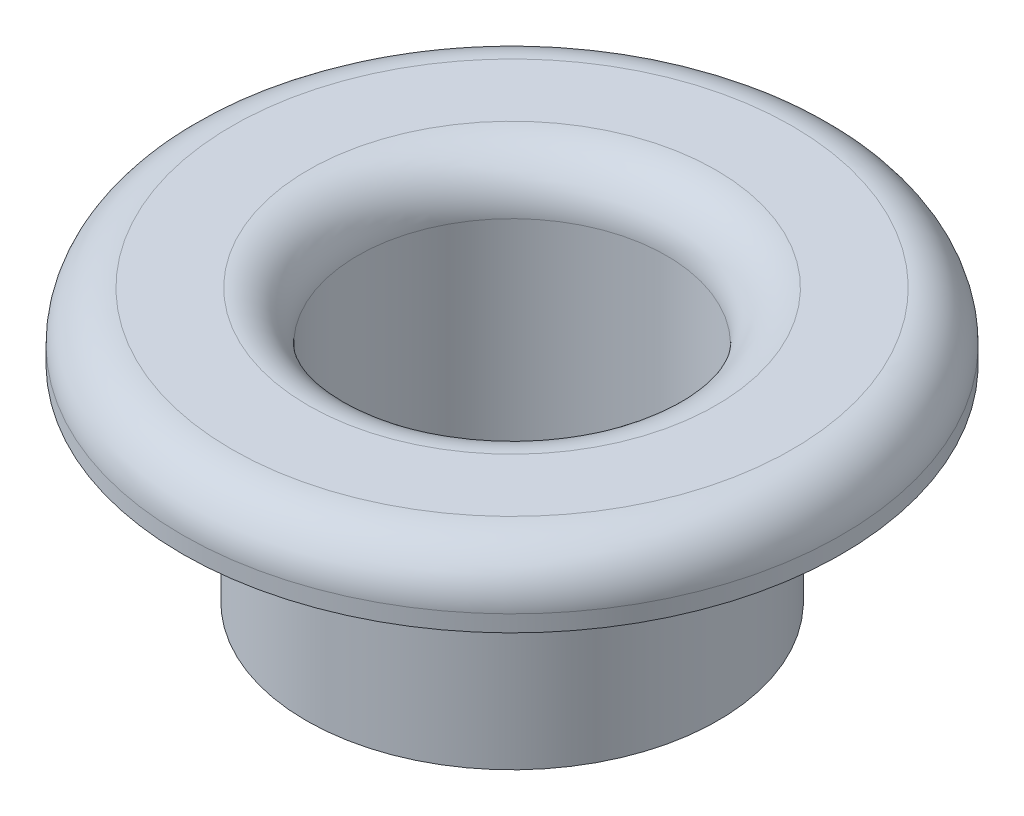
ISO-10303-21;
HEADER;
FILE_DESCRIPTION(('STEP AP214'),'2;1');
FILE_NAME('part.step','',(''),(''),'','','');
FILE_SCHEMA(('AUTOMOTIVE_DESIGN { 1 0 10303 214 1 1 1 1 }'));
ENDSEC;
DATA;
#1=APPLICATION_CONTEXT('core data for automotive mechanical design processes');
#2=APPLICATION_PROTOCOL_DEFINITION('international standard','automotive_design',2000,#1);
#3=PRODUCT_CONTEXT('',#1,'mechanical');
#4=PRODUCT('Part','Part','',(#3));
#5=PRODUCT_RELATED_PRODUCT_CATEGORY('part','',(#4));
#6=PRODUCT_DEFINITION_FORMATION('','',#4);
#7=PRODUCT_DEFINITION_CONTEXT('part definition',#1,'design');
#8=PRODUCT_DEFINITION('design','',#6,#7);
#9=PRODUCT_DEFINITION_SHAPE('','',#8);
#10=(LENGTH_UNIT() NAMED_UNIT(*) SI_UNIT(.MILLI.,.METRE.));
#11=(NAMED_UNIT(*) PLANE_ANGLE_UNIT() SI_UNIT($,.RADIAN.));
#12=(NAMED_UNIT(*) SI_UNIT($,.STERADIAN.) SOLID_ANGLE_UNIT());
#13=UNCERTAINTY_MEASURE_WITH_UNIT(LENGTH_MEASURE(1.E-05),#10,'distance_accuracy_value','');
#14=(GEOMETRIC_REPRESENTATION_CONTEXT(3) GLOBAL_UNCERTAINTY_ASSIGNED_CONTEXT((#13)) GLOBAL_UNIT_ASSIGNED_CONTEXT((#10,
#11,#12)) REPRESENTATION_CONTEXT('',''));
#15=CARTESIAN_POINT('',(0.,0.,0.));
#16=DIRECTION('',(0.,0.,1.));
#17=DIRECTION('',(1.,0.,0.));
#18=AXIS2_PLACEMENT_3D('',#15,#16,#17);
#19=CARTESIAN_POINT('',(0.,0.,0.));
#20=DIRECTION('',(0.,1.,0.));
#21=DIRECTION('',(0.,0.,1.));
#22=AXIS2_PLACEMENT_3D('',#19,#20,#21);
#23=PLANE('',#22);
#24=CARTESIAN_POINT('',(0.,0.,0.));
#25=DIRECTION('',(0.,1.,0.));
#26=DIRECTION('',(0.,0.,1.));
#27=AXIS2_PLACEMENT_3D('',#24,#25,#26);
#28=CIRCLE('',#27,3.175);
#29=CARTESIAN_POINT('',(0.,0.,3.175));
#30=VERTEX_POINT('',#29);
#31=EDGE_CURVE('E73',#30,#30,#28,.T.);
#32=ORIENTED_EDGE('',*,*,#31,.F.);
#33=EDGE_LOOP('',(#32));
#34=FACE_BOUND('',#33,.T.);
#35=CARTESIAN_POINT('',(0.,0.,0.));
#36=DIRECTION('',(0.,1.,0.));
#37=DIRECTION('',(0.,0.,1.));
#38=AXIS2_PLACEMENT_3D('',#35,#36,#37);
#39=CIRCLE('',#38,2.38125);
#40=CARTESIAN_POINT('',(0.,0.,2.38125));
#41=VERTEX_POINT('',#40);
#42=EDGE_CURVE('E76',#41,#41,#39,.T.);
#43=ORIENTED_EDGE('',*,*,#42,.T.);
#44=EDGE_LOOP('',(#43));
#45=FACE_BOUND('',#44,.T.);
#46=ADVANCED_FACE('F46',(#34,#45),#23,.F.);
#47=CARTESIAN_POINT('',(0.,3.175,0.));
#48=DIRECTION('',(0.,-1.,0.));
#49=DIRECTION('',(0.,0.,-1.));
#50=AXIS2_PLACEMENT_3D('',#47,#48,#49);
#51=CYLINDRICAL_SURFACE('',#50,3.175);
#52=CARTESIAN_POINT('',(0.,3.175,0.));
#53=DIRECTION('',(0.,1.,0.));
#54=DIRECTION('',(0.,0.,1.));
#55=AXIS2_PLACEMENT_3D('',#52,#53,#54);
#56=CIRCLE('',#55,3.175);
#57=CARTESIAN_POINT('',(0.,3.175,3.175));
#58=VERTEX_POINT('',#57);
#59=EDGE_CURVE('E72',#58,#58,#56,.T.);
#60=ORIENTED_EDGE('',*,*,#59,.F.);
#61=EDGE_LOOP('',(#60));
#62=FACE_BOUND('',#61,.T.);
#63=ORIENTED_EDGE('',*,*,#31,.T.);
#64=EDGE_LOOP('',(#63));
#65=FACE_BOUND('',#64,.T.);
#66=ADVANCED_FACE('F104',(#62,#65),#51,.T.);
#67=CARTESIAN_POINT('',(0.,3.175,0.));
#68=DIRECTION('',(0.,-1.,0.));
#69=DIRECTION('',(0.,0.,-1.));
#70=AXIS2_PLACEMENT_3D('',#67,#68,#69);
#71=CYLINDRICAL_SURFACE('',#70,2.38125);
#72=CARTESIAN_POINT('',(0.,3.429,0.));
#73=DIRECTION('',(0.,1.,0.));
#74=DIRECTION('',(0.,0.,1.));
#75=AXIS2_PLACEMENT_3D('',#72,#73,#74);
#76=CIRCLE('',#75,2.38125);
#77=CARTESIAN_POINT('',(0.,3.429,2.38125));
#78=VERTEX_POINT('',#77);
#79=EDGE_CURVE('E12',#78,#78,#76,.T.);
#80=ORIENTED_EDGE('',*,*,#79,.T.);
#81=EDGE_LOOP('',(#80));
#82=FACE_BOUND('',#81,.T.);
#83=ORIENTED_EDGE('',*,*,#42,.F.);
#84=EDGE_LOOP('',(#83));
#85=FACE_BOUND('',#84,.T.);
#86=ADVANCED_FACE('F100',(#82,#85),#71,.F.);
#87=CARTESIAN_POINT('',(0.,4.191,0.));
#88=DIRECTION('',(0.,1.,0.));
#89=DIRECTION('',(0.,0.,1.));
#90=AXIS2_PLACEMENT_3D('',#87,#88,#89);
#91=PLANE('',#90);
#92=CARTESIAN_POINT('',(0.,4.191,0.));
#93=DIRECTION('',(0.,1.,0.));
#94=DIRECTION('',(0.,0.,1.));
#95=AXIS2_PLACEMENT_3D('',#92,#93,#94);
#96=CIRCLE('',#95,4.318);
#97=CARTESIAN_POINT('',(0.,4.191,4.318));
#98=VERTEX_POINT('',#97);
#99=EDGE_CURVE('E61',#98,#98,#96,.T.);
#100=ORIENTED_EDGE('',*,*,#99,.T.);
#101=EDGE_LOOP('',(#100));
#102=FACE_BOUND('',#101,.T.);
#103=CARTESIAN_POINT('',(0.,4.191,0.));
#104=DIRECTION('',(0.,1.,0.));
#105=DIRECTION('',(0.,0.,1.));
#106=AXIS2_PLACEMENT_3D('',#103,#104,#105);
#107=CIRCLE('',#106,3.14325);
#108=CARTESIAN_POINT('',(0.,4.191,3.14325));
#109=VERTEX_POINT('',#108);
#110=EDGE_CURVE('E67',#109,#109,#107,.F.);
#111=ORIENTED_EDGE('',*,*,#110,.T.);
#112=EDGE_LOOP('',(#111));
#113=FACE_BOUND('',#112,.T.);
#114=ADVANCED_FACE('F91',(#102,#113),#91,.T.);
#115=CARTESIAN_POINT('',(0.,3.175,0.));
#116=DIRECTION('',(0.,1.,0.));
#117=DIRECTION('',(0.,0.,1.));
#118=AXIS2_PLACEMENT_3D('',#115,#116,#117);
#119=PLANE('',#118);
#120=ORIENTED_EDGE('',*,*,#59,.T.);
#121=EDGE_LOOP('',(#120));
#122=FACE_BOUND('',#121,.T.);
#123=CARTESIAN_POINT('',(0.,3.175,0.));
#124=DIRECTION('',(0.,1.,0.));
#125=DIRECTION('',(0.,0.,1.));
#126=AXIS2_PLACEMENT_3D('',#123,#124,#125);
#127=CIRCLE('',#126,5.08);
#128=CARTESIAN_POINT('',(0.,3.175,5.08));
#129=VERTEX_POINT('',#128);
#130=EDGE_CURVE('E82',#129,#129,#127,.T.);
#131=ORIENTED_EDGE('',*,*,#130,.F.);
#132=EDGE_LOOP('',(#131));
#133=FACE_BOUND('',#132,.T.);
#134=ADVANCED_FACE('F89',(#122,#133),#119,.F.);
#135=CARTESIAN_POINT('',(0.,4.191,0.));
#136=DIRECTION('',(0.,-1.,0.));
#137=DIRECTION('',(0.,0.,-1.));
#138=AXIS2_PLACEMENT_3D('',#135,#136,#137);
#139=CYLINDRICAL_SURFACE('',#138,5.08);
#140=CARTESIAN_POINT('',(0.,3.429,0.));
#141=DIRECTION('',(0.,1.,0.));
#142=DIRECTION('',(0.,0.,1.));
#143=AXIS2_PLACEMENT_3D('',#140,#141,#142);
#144=CIRCLE('',#143,5.08);
#145=CARTESIAN_POINT('',(0.,3.429,5.08));
#146=VERTEX_POINT('',#145);
#147=EDGE_CURVE('E54',#146,#146,#144,.F.);
#148=ORIENTED_EDGE('',*,*,#147,.T.);
#149=EDGE_LOOP('',(#148));
#150=FACE_BOUND('',#149,.T.);
#151=ORIENTED_EDGE('',*,*,#130,.T.);
#152=EDGE_LOOP('',(#151));
#153=FACE_BOUND('',#152,.T.);
#154=ADVANCED_FACE('F87',(#150,#153),#139,.T.);
#155=CARTESIAN_POINT('',(0.,3.429,0.));
#156=DIRECTION('',(0.,1.,0.));
#157=DIRECTION('',(0.,0.,1.));
#158=AXIS2_PLACEMENT_3D('',#155,#156,#157);
#159=TOROIDAL_SURFACE('',#158,4.318,0.762);
#160=ORIENTED_EDGE('',*,*,#147,.F.);
#161=EDGE_LOOP('',(#160));
#162=FACE_BOUND('',#161,.T.);
#163=ORIENTED_EDGE('',*,*,#99,.F.);
#164=EDGE_LOOP('',(#163));
#165=FACE_BOUND('',#164,.T.);
#166=ADVANCED_FACE('F98',(#162,#165),#159,.T.);
#167=CARTESIAN_POINT('',(0.,3.429,0.));
#168=DIRECTION('',(0.,1.,0.));
#169=DIRECTION('',(0.,0.,1.));
#170=AXIS2_PLACEMENT_3D('',#167,#168,#169);
#171=TOROIDAL_SURFACE('',#170,3.14325,0.762);
#172=ORIENTED_EDGE('',*,*,#110,.F.);
#173=EDGE_LOOP('',(#172));
#174=FACE_BOUND('',#173,.T.);
#175=ORIENTED_EDGE('',*,*,#79,.F.);
#176=EDGE_LOOP('',(#175));
#177=FACE_BOUND('',#176,.T.);
#178=ADVANCED_FACE('F48',(#174,#177),#171,.T.);
#179=CLOSED_SHELL('',(#46,#66,#86,#114,#134,#154,#166,#178));
#180=MANIFOLD_SOLID_BREP('B2',#179);
#181=ADVANCED_BREP_SHAPE_REPRESENTATION('',(#18,#180),#14);
#182=SHAPE_DEFINITION_REPRESENTATION(#9,#181);
ENDSEC;
END-ISO-10303-21;
